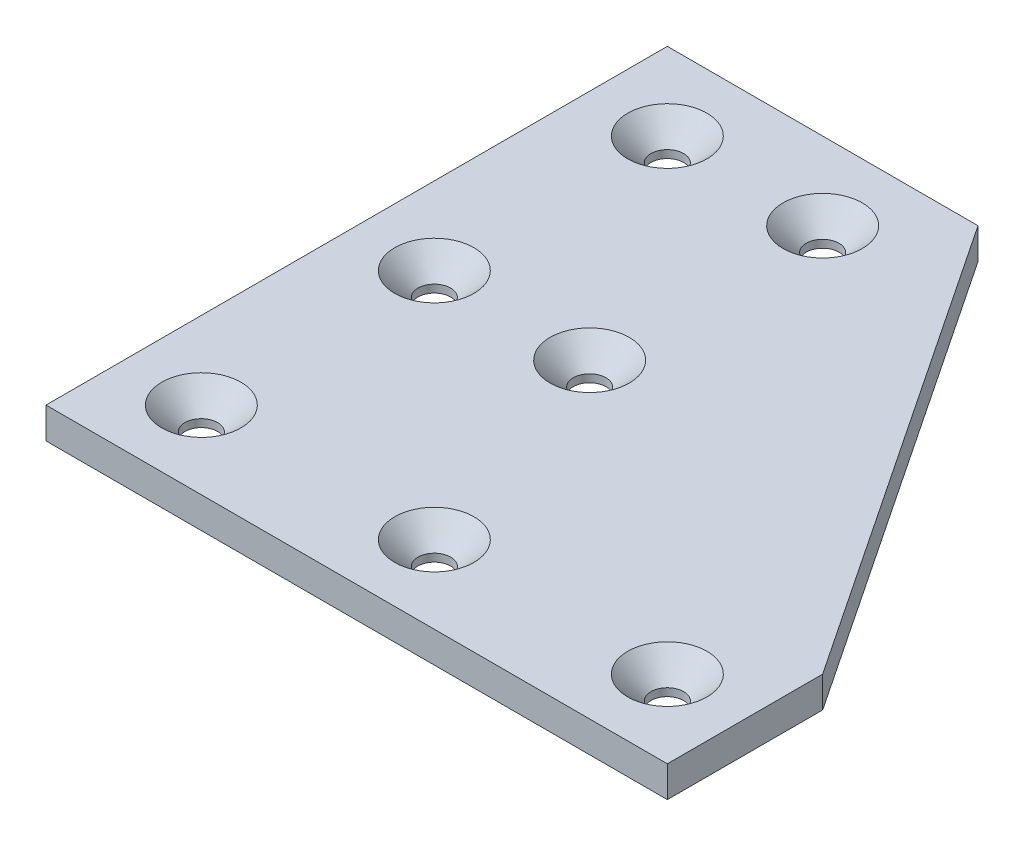
ISO-10303-21;
HEADER;
FILE_DESCRIPTION(('STEP AP214'),'2;1');
FILE_NAME('part.step','',(''),(''),'','','');
FILE_SCHEMA(('AUTOMOTIVE_DESIGN { 1 0 10303 214 1 1 1 1 }'));
ENDSEC;
DATA;
#1=APPLICATION_CONTEXT('core data for automotive mechanical design processes');
#2=APPLICATION_PROTOCOL_DEFINITION('international standard','automotive_design',2000,#1);
#3=PRODUCT_CONTEXT('',#1,'mechanical');
#4=PRODUCT('Part','Part','',(#3));
#5=PRODUCT_RELATED_PRODUCT_CATEGORY('part','',(#4));
#6=PRODUCT_DEFINITION_FORMATION('','',#4);
#7=PRODUCT_DEFINITION_CONTEXT('part definition',#1,'design');
#8=PRODUCT_DEFINITION('design','',#6,#7);
#9=PRODUCT_DEFINITION_SHAPE('','',#8);
#10=(LENGTH_UNIT() NAMED_UNIT(*) SI_UNIT(.MILLI.,.METRE.));
#11=(NAMED_UNIT(*) PLANE_ANGLE_UNIT() SI_UNIT($,.RADIAN.));
#12=(NAMED_UNIT(*) SI_UNIT($,.STERADIAN.) SOLID_ANGLE_UNIT());
#13=UNCERTAINTY_MEASURE_WITH_UNIT(LENGTH_MEASURE(1.E-05),#10,'distance_accuracy_value','');
#14=(GEOMETRIC_REPRESENTATION_CONTEXT(3) GLOBAL_UNCERTAINTY_ASSIGNED_CONTEXT((#13)) GLOBAL_UNIT_ASSIGNED_CONTEXT((#10,
#11,#12)) REPRESENTATION_CONTEXT('',''));
#15=CARTESIAN_POINT('',(0.,0.,0.));
#16=DIRECTION('',(0.,0.,1.));
#17=DIRECTION('',(1.,0.,0.));
#18=AXIS2_PLACEMENT_3D('',#15,#16,#17);
#19=CARTESIAN_POINT('',(0.,4.,-80.));
#20=DIRECTION('',(1.,0.,0.));
#21=DIRECTION('',(0.,0.,-1.));
#22=AXIS2_PLACEMENT_3D('',#19,#20,#21);
#23=PLANE('',#22);
#24=DIRECTION('',(0.,0.,1.));
#25=VECTOR('',#24,1.);
#26=CARTESIAN_POINT('',(0.,0.,-80.));
#27=LINE('',#26,#25);
#28=CARTESIAN_POINT('',(0.,0.,-80.));
#29=VERTEX_POINT('',#28);
#30=CARTESIAN_POINT('',(0.,0.,0.));
#31=VERTEX_POINT('',#30);
#32=EDGE_CURVE('E128',#29,#31,#27,.T.);
#33=ORIENTED_EDGE('',*,*,#32,.T.);
#34=DIRECTION('',(0.,-1.,0.));
#35=VECTOR('',#34,1.);
#36=CARTESIAN_POINT('',(0.,4.,0.));
#37=LINE('',#36,#35);
#38=CARTESIAN_POINT('',(0.,4.,0.));
#39=VERTEX_POINT('',#38);
#40=EDGE_CURVE('E149',#39,#31,#37,.T.);
#41=ORIENTED_EDGE('',*,*,#40,.F.);
#42=DIRECTION('',(0.,0.,1.));
#43=VECTOR('',#42,1.);
#44=CARTESIAN_POINT('',(0.,4.,-80.));
#45=LINE('',#44,#43);
#46=CARTESIAN_POINT('',(0.,4.,-80.));
#47=VERTEX_POINT('',#46);
#48=EDGE_CURVE('E142',#47,#39,#45,.T.);
#49=ORIENTED_EDGE('',*,*,#48,.F.);
#50=DIRECTION('',(0.,-1.,0.));
#51=VECTOR('',#50,1.);
#52=CARTESIAN_POINT('',(0.,4.,-80.));
#53=LINE('',#52,#51);
#54=EDGE_CURVE('E124',#47,#29,#53,.T.);
#55=ORIENTED_EDGE('',*,*,#54,.T.);
#56=EDGE_LOOP('',(#33,#41,#49,#55));
#57=FACE_BOUND('',#56,.T.);
#58=ADVANCED_FACE('F45',(#57),#23,.F.);
#59=CARTESIAN_POINT('',(0.,4.,0.));
#60=DIRECTION('',(0.,0.,-1.));
#61=DIRECTION('',(-1.,0.,0.));
#62=AXIS2_PLACEMENT_3D('',#59,#60,#61);
#63=PLANE('',#62);
#64=DIRECTION('',(1.,0.,0.));
#65=VECTOR('',#64,1.);
#66=CARTESIAN_POINT('',(0.,0.,0.));
#67=LINE('',#66,#65);
#68=CARTESIAN_POINT('',(80.,0.,0.));
#69=VERTEX_POINT('',#68);
#70=EDGE_CURVE('E132',#31,#69,#67,.T.);
#71=ORIENTED_EDGE('',*,*,#70,.T.);
#72=DIRECTION('',(0.,-1.,0.));
#73=VECTOR('',#72,1.);
#74=CARTESIAN_POINT('',(80.,4.,0.));
#75=LINE('',#74,#73);
#76=CARTESIAN_POINT('',(80.,4.,0.));
#77=VERTEX_POINT('',#76);
#78=EDGE_CURVE('E117',#77,#69,#75,.T.);
#79=ORIENTED_EDGE('',*,*,#78,.F.);
#80=DIRECTION('',(1.,0.,0.));
#81=VECTOR('',#80,1.);
#82=CARTESIAN_POINT('',(0.,4.,0.));
#83=LINE('',#82,#81);
#84=EDGE_CURVE('E99',#39,#77,#83,.T.);
#85=ORIENTED_EDGE('',*,*,#84,.F.);
#86=ORIENTED_EDGE('',*,*,#40,.T.);
#87=EDGE_LOOP('',(#71,#79,#85,#86));
#88=FACE_BOUND('',#87,.T.);
#89=ADVANCED_FACE('F221',(#88),#63,.F.);
#90=CARTESIAN_POINT('',(80.,4.,0.));
#91=DIRECTION('',(-1.,0.,0.));
#92=DIRECTION('',(0.,0.,1.));
#93=AXIS2_PLACEMENT_3D('',#90,#91,#92);
#94=PLANE('',#93);
#95=DIRECTION('',(0.,0.,-1.));
#96=VECTOR('',#95,1.);
#97=CARTESIAN_POINT('',(80.,0.,0.));
#98=LINE('',#97,#96);
#99=CARTESIAN_POINT('',(80.,0.,-20.));
#100=VERTEX_POINT('',#99);
#101=EDGE_CURVE('E115',#69,#100,#98,.T.);
#102=ORIENTED_EDGE('',*,*,#101,.T.);
#103=DIRECTION('',(0.,-1.,0.));
#104=VECTOR('',#103,1.);
#105=CARTESIAN_POINT('',(80.,4.,-20.));
#106=LINE('',#105,#104);
#107=CARTESIAN_POINT('',(80.,4.,-20.));
#108=VERTEX_POINT('',#107);
#109=EDGE_CURVE('E112',#108,#100,#106,.T.);
#110=ORIENTED_EDGE('',*,*,#109,.F.);
#111=DIRECTION('',(0.,0.,-1.));
#112=VECTOR('',#111,1.);
#113=CARTESIAN_POINT('',(80.,4.,0.));
#114=LINE('',#113,#112);
#115=EDGE_CURVE('E103',#77,#108,#114,.T.);
#116=ORIENTED_EDGE('',*,*,#115,.F.);
#117=ORIENTED_EDGE('',*,*,#78,.T.);
#118=EDGE_LOOP('',(#102,#110,#116,#117));
#119=FACE_BOUND('',#118,.T.);
#120=ADVANCED_FACE('F113',(#119),#94,.F.);
#121=CARTESIAN_POINT('',(80.,4.,-20.));
#122=DIRECTION('',(-0.832050294337844,0.,0.554700196225229));
#123=DIRECTION('',(0.554700196225229,0.,0.832050294337844));
#124=AXIS2_PLACEMENT_3D('',#121,#122,#123);
#125=PLANE('',#124);
#126=DIRECTION('',(-0.554700196225229,0.,-0.832050294337844));
#127=VECTOR('',#126,1.);
#128=CARTESIAN_POINT('',(80.,0.,-20.));
#129=LINE('',#128,#127);
#130=CARTESIAN_POINT('',(40.,0.,-80.));
#131=VERTEX_POINT('',#130);
#132=EDGE_CURVE('E84',#100,#131,#129,.T.);
#133=ORIENTED_EDGE('',*,*,#132,.T.);
#134=DIRECTION('',(0.,-1.,0.));
#135=VECTOR('',#134,1.);
#136=CARTESIAN_POINT('',(40.,4.,-80.));
#137=LINE('',#136,#135);
#138=CARTESIAN_POINT('',(40.,4.,-80.));
#139=VERTEX_POINT('',#138);
#140=EDGE_CURVE('E118',#139,#131,#137,.T.);
#141=ORIENTED_EDGE('',*,*,#140,.F.);
#142=DIRECTION('',(-0.554700196225229,0.,-0.832050294337844));
#143=VECTOR('',#142,1.);
#144=CARTESIAN_POINT('',(80.,4.,-20.));
#145=LINE('',#144,#143);
#146=EDGE_CURVE('E107',#108,#139,#145,.T.);
#147=ORIENTED_EDGE('',*,*,#146,.F.);
#148=ORIENTED_EDGE('',*,*,#109,.T.);
#149=EDGE_LOOP('',(#133,#141,#147,#148));
#150=FACE_BOUND('',#149,.T.);
#151=ADVANCED_FACE('F120',(#150),#125,.F.);
#152=CARTESIAN_POINT('',(40.,4.,-80.));
#153=DIRECTION('',(0.,0.,1.));
#154=DIRECTION('',(1.,0.,0.));
#155=AXIS2_PLACEMENT_3D('',#152,#153,#154);
#156=PLANE('',#155);
#157=DIRECTION('',(-1.,0.,0.));
#158=VECTOR('',#157,1.);
#159=CARTESIAN_POINT('',(40.,0.,-80.));
#160=LINE('',#159,#158);
#161=EDGE_CURVE('E90',#131,#29,#160,.T.);
#162=ORIENTED_EDGE('',*,*,#161,.T.);
#163=ORIENTED_EDGE('',*,*,#54,.F.);
#164=DIRECTION('',(-1.,0.,0.));
#165=VECTOR('',#164,1.);
#166=CARTESIAN_POINT('',(40.,4.,-80.));
#167=LINE('',#166,#165);
#168=EDGE_CURVE('E64',#139,#47,#167,.T.);
#169=ORIENTED_EDGE('',*,*,#168,.F.);
#170=ORIENTED_EDGE('',*,*,#140,.T.);
#171=EDGE_LOOP('',(#162,#163,#169,#170));
#172=FACE_BOUND('',#171,.T.);
#173=ADVANCED_FACE('F337',(#172),#156,.F.);
#174=CARTESIAN_POINT('',(0.,4.,0.));
#175=DIRECTION('',(0.,1.,0.));
#176=DIRECTION('',(0.,0.,1.));
#177=AXIS2_PLACEMENT_3D('',#174,#175,#176);
#178=PLANE('',#177);
#179=CARTESIAN_POINT('',(70.,4.,-9.99999999999999));
#180=DIRECTION('',(0.,1.,0.));
#181=DIRECTION('',(0.,0.,1.));
#182=AXIS2_PLACEMENT_3D('',#179,#180,#181);
#183=CIRCLE('',#182,5.10000000000001);
#184=CARTESIAN_POINT('',(70.,4.,-4.89999999999999));
#185=VERTEX_POINT('',#184);
#186=EDGE_CURVE('E180',#185,#185,#183,.F.);
#187=ORIENTED_EDGE('',*,*,#186,.T.);
#188=EDGE_LOOP('',(#187));
#189=FACE_BOUND('',#188,.T.);
#190=CARTESIAN_POINT('',(40.,4.,-9.99999999999999));
#191=DIRECTION('',(0.,1.,0.));
#192=DIRECTION('',(0.,0.,1.));
#193=AXIS2_PLACEMENT_3D('',#190,#191,#192);
#194=CIRCLE('',#193,5.10000000000001);
#195=CARTESIAN_POINT('',(40.,4.,-4.89999999999999));
#196=VERTEX_POINT('',#195);
#197=EDGE_CURVE('E176',#196,#196,#194,.F.);
#198=ORIENTED_EDGE('',*,*,#197,.T.);
#199=EDGE_LOOP('',(#198));
#200=FACE_BOUND('',#199,.T.);
#201=CARTESIAN_POINT('',(10.,4.,-9.99999999999999));
#202=DIRECTION('',(0.,1.,0.));
#203=DIRECTION('',(0.,0.,1.));
#204=AXIS2_PLACEMENT_3D('',#201,#202,#203);
#205=CIRCLE('',#204,5.10000000000001);
#206=CARTESIAN_POINT('',(10.,4.,-4.89999999999999));
#207=VERTEX_POINT('',#206);
#208=EDGE_CURVE('E172',#207,#207,#205,.F.);
#209=ORIENTED_EDGE('',*,*,#208,.T.);
#210=EDGE_LOOP('',(#209));
#211=FACE_BOUND('',#210,.T.);
#212=CARTESIAN_POINT('',(29.9999999999999,4.,-40.));
#213=DIRECTION('',(0.,1.,0.));
#214=DIRECTION('',(0.,0.,1.));
#215=AXIS2_PLACEMENT_3D('',#212,#213,#214);
#216=CIRCLE('',#215,5.10000000000004);
#217=CARTESIAN_POINT('',(29.9999999999999,4.,-34.9));
#218=VERTEX_POINT('',#217);
#219=EDGE_CURVE('E168',#218,#218,#216,.F.);
#220=ORIENTED_EDGE('',*,*,#219,.T.);
#221=EDGE_LOOP('',(#220));
#222=FACE_BOUND('',#221,.T.);
#223=CARTESIAN_POINT('',(9.9999999999999,4.,-40.));
#224=DIRECTION('',(0.,1.,0.));
#225=DIRECTION('',(0.,0.,1.));
#226=AXIS2_PLACEMENT_3D('',#223,#224,#225);
#227=CIRCLE('',#226,5.10000000000004);
#228=CARTESIAN_POINT('',(9.9999999999999,4.,-34.9));
#229=VERTEX_POINT('',#228);
#230=EDGE_CURVE('E164',#229,#229,#227,.F.);
#231=ORIENTED_EDGE('',*,*,#230,.T.);
#232=EDGE_LOOP('',(#231));
#233=FACE_BOUND('',#232,.T.);
#234=CARTESIAN_POINT('',(29.9999999999998,4.,-70.));
#235=DIRECTION('',(0.,1.,0.));
#236=DIRECTION('',(0.,0.,1.));
#237=AXIS2_PLACEMENT_3D('',#234,#235,#236);
#238=CIRCLE('',#237,5.10000000000001);
#239=CARTESIAN_POINT('',(29.9999999999998,4.,-64.9));
#240=VERTEX_POINT('',#239);
#241=EDGE_CURVE('E160',#240,#240,#238,.F.);
#242=ORIENTED_EDGE('',*,*,#241,.T.);
#243=EDGE_LOOP('',(#242));
#244=FACE_BOUND('',#243,.T.);
#245=CARTESIAN_POINT('',(9.99999999999979,4.,-70.));
#246=DIRECTION('',(0.,1.,0.));
#247=DIRECTION('',(0.,0.,1.));
#248=AXIS2_PLACEMENT_3D('',#245,#246,#247);
#249=CIRCLE('',#248,5.10000000000001);
#250=CARTESIAN_POINT('',(9.99999999999979,4.,-64.9));
#251=VERTEX_POINT('',#250);
#252=EDGE_CURVE('E156',#251,#251,#249,.F.);
#253=ORIENTED_EDGE('',*,*,#252,.T.);
#254=EDGE_LOOP('',(#253));
#255=FACE_BOUND('',#254,.T.);
#256=ORIENTED_EDGE('',*,*,#48,.T.);
#257=ORIENTED_EDGE('',*,*,#84,.T.);
#258=ORIENTED_EDGE('',*,*,#115,.T.);
#259=ORIENTED_EDGE('',*,*,#146,.T.);
#260=ORIENTED_EDGE('',*,*,#168,.T.);
#261=EDGE_LOOP('',(#256,#257,#258,#259,#260));
#262=FACE_BOUND('',#261,.T.);
#263=ADVANCED_FACE('F105',(#189,#200,#211,#222,#233,#244,#255,#262),#178,.T.);
#264=CARTESIAN_POINT('',(0.,0.,0.));
#265=DIRECTION('',(0.,1.,0.));
#266=DIRECTION('',(0.,0.,1.));
#267=AXIS2_PLACEMENT_3D('',#264,#265,#266);
#268=PLANE('',#267);
#269=CARTESIAN_POINT('',(9.99999999999979,0.,-70.));
#270=DIRECTION('',(0.,1.,0.));
#271=DIRECTION('',(0.,0.,1.));
#272=AXIS2_PLACEMENT_3D('',#269,#270,#271);
#273=CIRCLE('',#272,2.1);
#274=CARTESIAN_POINT('',(9.99999999999979,0.,-67.9));
#275=VERTEX_POINT('',#274);
#276=EDGE_CURVE('E296',#275,#275,#273,.T.);
#277=ORIENTED_EDGE('',*,*,#276,.T.);
#278=EDGE_LOOP('',(#277));
#279=FACE_BOUND('',#278,.T.);
#280=CARTESIAN_POINT('',(9.9999999999999,0.,-40.));
#281=DIRECTION('',(0.,1.,0.));
#282=DIRECTION('',(0.,0.,1.));
#283=AXIS2_PLACEMENT_3D('',#280,#281,#282);
#284=CIRCLE('',#283,2.1);
#285=CARTESIAN_POINT('',(9.9999999999999,0.,-37.9));
#286=VERTEX_POINT('',#285);
#287=EDGE_CURVE('E289',#286,#286,#284,.T.);
#288=ORIENTED_EDGE('',*,*,#287,.T.);
#289=EDGE_LOOP('',(#288));
#290=FACE_BOUND('',#289,.T.);
#291=CARTESIAN_POINT('',(29.9999999999998,0.,-70.));
#292=DIRECTION('',(0.,1.,0.));
#293=DIRECTION('',(0.,0.,1.));
#294=AXIS2_PLACEMENT_3D('',#291,#292,#293);
#295=CIRCLE('',#294,2.1);
#296=CARTESIAN_POINT('',(29.9999999999998,0.,-67.9));
#297=VERTEX_POINT('',#296);
#298=EDGE_CURVE('E281',#297,#297,#295,.T.);
#299=ORIENTED_EDGE('',*,*,#298,.T.);
#300=EDGE_LOOP('',(#299));
#301=FACE_BOUND('',#300,.T.);
#302=CARTESIAN_POINT('',(29.9999999999999,0.,-40.));
#303=DIRECTION('',(0.,1.,0.));
#304=DIRECTION('',(0.,0.,1.));
#305=AXIS2_PLACEMENT_3D('',#302,#303,#304);
#306=CIRCLE('',#305,2.1);
#307=CARTESIAN_POINT('',(29.9999999999999,0.,-37.9));
#308=VERTEX_POINT('',#307);
#309=EDGE_CURVE('E277',#308,#308,#306,.T.);
#310=ORIENTED_EDGE('',*,*,#309,.T.);
#311=EDGE_LOOP('',(#310));
#312=FACE_BOUND('',#311,.T.);
#313=CARTESIAN_POINT('',(70.,0.,-9.99999999999999));
#314=DIRECTION('',(0.,1.,0.));
#315=DIRECTION('',(0.,0.,1.));
#316=AXIS2_PLACEMENT_3D('',#313,#314,#315);
#317=CIRCLE('',#316,2.1);
#318=CARTESIAN_POINT('',(70.,0.,-7.89999999999999));
#319=VERTEX_POINT('',#318);
#320=EDGE_CURVE('E280',#319,#319,#317,.T.);
#321=ORIENTED_EDGE('',*,*,#320,.T.);
#322=EDGE_LOOP('',(#321));
#323=FACE_BOUND('',#322,.T.);
#324=CARTESIAN_POINT('',(40.,0.,-9.99999999999999));
#325=DIRECTION('',(0.,1.,0.));
#326=DIRECTION('',(0.,0.,1.));
#327=AXIS2_PLACEMENT_3D('',#324,#325,#326);
#328=CIRCLE('',#327,2.1);
#329=CARTESIAN_POINT('',(40.,0.,-7.9));
#330=VERTEX_POINT('',#329);
#331=EDGE_CURVE('E286',#330,#330,#328,.T.);
#332=ORIENTED_EDGE('',*,*,#331,.T.);
#333=EDGE_LOOP('',(#332));
#334=FACE_BOUND('',#333,.T.);
#335=CARTESIAN_POINT('',(10.,0.,-9.99999999999999));
#336=DIRECTION('',(0.,1.,0.));
#337=DIRECTION('',(0.,0.,1.));
#338=AXIS2_PLACEMENT_3D('',#335,#336,#337);
#339=CIRCLE('',#338,2.1);
#340=CARTESIAN_POINT('',(10.,0.,-7.89999999999999));
#341=VERTEX_POINT('',#340);
#342=EDGE_CURVE('E133',#341,#341,#339,.T.);
#343=ORIENTED_EDGE('',*,*,#342,.T.);
#344=EDGE_LOOP('',(#343));
#345=FACE_BOUND('',#344,.T.);
#346=ORIENTED_EDGE('',*,*,#32,.F.);
#347=ORIENTED_EDGE('',*,*,#161,.F.);
#348=ORIENTED_EDGE('',*,*,#132,.F.);
#349=ORIENTED_EDGE('',*,*,#101,.F.);
#350=ORIENTED_EDGE('',*,*,#70,.F.);
#351=EDGE_LOOP('',(#346,#347,#348,#349,#350));
#352=FACE_BOUND('',#351,.T.);
#353=ADVANCED_FACE('F309',(#279,#290,#301,#312,#323,#334,#345,#352),#268,.F.);
#354=CARTESIAN_POINT('',(10.,0.,-9.99999999999999));
#355=DIRECTION('',(0.,1.,0.));
#356=DIRECTION('',(0.,0.,1.));
#357=AXIS2_PLACEMENT_3D('',#354,#355,#356);
#358=CYLINDRICAL_SURFACE('',#357,2.1);
#359=CARTESIAN_POINT('',(10.,1.,-9.99999999999999));
#360=DIRECTION('',(0.,1.,0.));
#361=DIRECTION('',(0.,0.,1.));
#362=AXIS2_PLACEMENT_3D('',#359,#360,#361);
#363=CIRCLE('',#362,2.1);
#364=CARTESIAN_POINT('',(10.,1.,-7.89999999999999));
#365=VERTEX_POINT('',#364);
#366=EDGE_CURVE('E188',#365,#365,#363,.T.);
#367=ORIENTED_EDGE('',*,*,#366,.T.);
#368=EDGE_LOOP('',(#367));
#369=FACE_BOUND('',#368,.T.);
#370=ORIENTED_EDGE('',*,*,#342,.F.);
#371=EDGE_LOOP('',(#370));
#372=FACE_BOUND('',#371,.T.);
#373=ADVANCED_FACE('F314',(#369,#372),#358,.F.);
#374=CARTESIAN_POINT('',(40.,0.,-9.99999999999999));
#375=DIRECTION('',(0.,1.,0.));
#376=DIRECTION('',(0.,0.,1.));
#377=AXIS2_PLACEMENT_3D('',#374,#375,#376);
#378=CYLINDRICAL_SURFACE('',#377,2.1);
#379=CARTESIAN_POINT('',(40.,0.999999999999997,-9.99999999999999));
#380=DIRECTION('',(0.,1.,0.));
#381=DIRECTION('',(0.,0.,1.));
#382=AXIS2_PLACEMENT_3D('',#379,#380,#381);
#383=CIRCLE('',#382,2.1);
#384=CARTESIAN_POINT('',(40.,0.999999999999997,-7.9));
#385=VERTEX_POINT('',#384);
#386=EDGE_CURVE('E184',#385,#385,#383,.T.);
#387=ORIENTED_EDGE('',*,*,#386,.T.);
#388=EDGE_LOOP('',(#387));
#389=FACE_BOUND('',#388,.T.);
#390=ORIENTED_EDGE('',*,*,#331,.F.);
#391=EDGE_LOOP('',(#390));
#392=FACE_BOUND('',#391,.T.);
#393=ADVANCED_FACE('F312',(#389,#392),#378,.F.);
#394=CARTESIAN_POINT('',(70.,0.,-9.99999999999999));
#395=DIRECTION('',(0.,1.,0.));
#396=DIRECTION('',(0.,0.,1.));
#397=AXIS2_PLACEMENT_3D('',#394,#395,#396);
#398=CYLINDRICAL_SURFACE('',#397,2.1);
#399=CARTESIAN_POINT('',(70.,1.,-9.99999999999999));
#400=DIRECTION('',(0.,1.,0.));
#401=DIRECTION('',(0.,0.,1.));
#402=AXIS2_PLACEMENT_3D('',#399,#400,#401);
#403=CIRCLE('',#402,2.1);
#404=CARTESIAN_POINT('',(70.,1.,-7.89999999999999));
#405=VERTEX_POINT('',#404);
#406=EDGE_CURVE('E152',#405,#405,#403,.T.);
#407=ORIENTED_EDGE('',*,*,#406,.T.);
#408=EDGE_LOOP('',(#407));
#409=FACE_BOUND('',#408,.T.);
#410=ORIENTED_EDGE('',*,*,#320,.F.);
#411=EDGE_LOOP('',(#410));
#412=FACE_BOUND('',#411,.T.);
#413=ADVANCED_FACE('F273',(#409,#412),#398,.F.);
#414=CARTESIAN_POINT('',(29.9999999999999,0.,-40.));
#415=DIRECTION('',(0.,1.,0.));
#416=DIRECTION('',(0.,0.,1.));
#417=AXIS2_PLACEMENT_3D('',#414,#415,#416);
#418=CYLINDRICAL_SURFACE('',#417,2.1);
#419=CARTESIAN_POINT('',(29.9999999999999,0.999999999999977,-40.));
#420=DIRECTION('',(0.,1.,0.));
#421=DIRECTION('',(0.,0.,1.));
#422=AXIS2_PLACEMENT_3D('',#419,#420,#421);
#423=CIRCLE('',#422,2.1);
#424=CARTESIAN_POINT('',(29.9999999999999,0.999999999999977,-37.9));
#425=VERTEX_POINT('',#424);
#426=EDGE_CURVE('E192',#425,#425,#423,.T.);
#427=ORIENTED_EDGE('',*,*,#426,.T.);
#428=EDGE_LOOP('',(#427));
#429=FACE_BOUND('',#428,.T.);
#430=ORIENTED_EDGE('',*,*,#309,.F.);
#431=EDGE_LOOP('',(#430));
#432=FACE_BOUND('',#431,.T.);
#433=ADVANCED_FACE('F270',(#429,#432),#418,.F.);
#434=CARTESIAN_POINT('',(29.9999999999998,0.,-70.));
#435=DIRECTION('',(0.,1.,0.));
#436=DIRECTION('',(0.,0.,1.));
#437=AXIS2_PLACEMENT_3D('',#434,#435,#436);
#438=CYLINDRICAL_SURFACE('',#437,2.1);
#439=CARTESIAN_POINT('',(29.9999999999998,0.999999999999998,-70.));
#440=DIRECTION('',(0.,1.,0.));
#441=DIRECTION('',(0.,0.,1.));
#442=AXIS2_PLACEMENT_3D('',#439,#440,#441);
#443=CIRCLE('',#442,2.1);
#444=CARTESIAN_POINT('',(29.9999999999998,0.999999999999998,-67.9));
#445=VERTEX_POINT('',#444);
#446=EDGE_CURVE('E56',#445,#445,#443,.T.);
#447=ORIENTED_EDGE('',*,*,#446,.T.);
#448=EDGE_LOOP('',(#447));
#449=FACE_BOUND('',#448,.T.);
#450=ORIENTED_EDGE('',*,*,#298,.F.);
#451=EDGE_LOOP('',(#450));
#452=FACE_BOUND('',#451,.T.);
#453=ADVANCED_FACE('F203',(#449,#452),#438,.F.);
#454=CARTESIAN_POINT('',(9.9999999999999,0.,-40.));
#455=DIRECTION('',(0.,1.,0.));
#456=DIRECTION('',(0.,0.,1.));
#457=AXIS2_PLACEMENT_3D('',#454,#455,#456);
#458=CYLINDRICAL_SURFACE('',#457,2.1);
#459=CARTESIAN_POINT('',(9.9999999999999,0.999999999999974,-40.));
#460=DIRECTION('',(0.,1.,0.));
#461=DIRECTION('',(0.,0.,1.));
#462=AXIS2_PLACEMENT_3D('',#459,#460,#461);
#463=CIRCLE('',#462,2.1);
#464=CARTESIAN_POINT('',(9.9999999999999,0.999999999999974,-37.9));
#465=VERTEX_POINT('',#464);
#466=EDGE_CURVE('E196',#465,#465,#463,.T.);
#467=ORIENTED_EDGE('',*,*,#466,.T.);
#468=EDGE_LOOP('',(#467));
#469=FACE_BOUND('',#468,.T.);
#470=ORIENTED_EDGE('',*,*,#287,.F.);
#471=EDGE_LOOP('',(#470));
#472=FACE_BOUND('',#471,.T.);
#473=ADVANCED_FACE('F328',(#469,#472),#458,.F.);
#474=CARTESIAN_POINT('',(9.99999999999979,0.,-70.));
#475=DIRECTION('',(0.,1.,0.));
#476=DIRECTION('',(0.,0.,1.));
#477=AXIS2_PLACEMENT_3D('',#474,#475,#476);
#478=CYLINDRICAL_SURFACE('',#477,2.1);
#479=CARTESIAN_POINT('',(9.99999999999979,1.,-70.));
#480=DIRECTION('',(0.,1.,0.));
#481=DIRECTION('',(0.,0.,1.));
#482=AXIS2_PLACEMENT_3D('',#479,#480,#481);
#483=CIRCLE('',#482,2.1);
#484=CARTESIAN_POINT('',(9.99999999999979,1.,-67.9));
#485=VERTEX_POINT('',#484);
#486=EDGE_CURVE('E11',#485,#485,#483,.T.);
#487=ORIENTED_EDGE('',*,*,#486,.T.);
#488=EDGE_LOOP('',(#487));
#489=FACE_BOUND('',#488,.T.);
#490=ORIENTED_EDGE('',*,*,#276,.F.);
#491=EDGE_LOOP('',(#490));
#492=FACE_BOUND('',#491,.T.);
#493=ADVANCED_FACE('F238',(#489,#492),#478,.F.);
#494=CARTESIAN_POINT('',(70.,1.,-9.99999999999999));
#495=DIRECTION('',(0.,1.,0.));
#496=DIRECTION('',(0.,0.,1.));
#497=AXIS2_PLACEMENT_3D('',#494,#495,#496);
#498=CONICAL_SURFACE('',#497,2.1,0.785398163397449);
#499=ORIENTED_EDGE('',*,*,#186,.F.);
#500=EDGE_LOOP('',(#499));
#501=FACE_BOUND('',#500,.T.);
#502=ORIENTED_EDGE('',*,*,#406,.F.);
#503=EDGE_LOOP('',(#502));
#504=FACE_BOUND('',#503,.T.);
#505=ADVANCED_FACE('F231',(#501,#504),#498,.F.);
#506=CARTESIAN_POINT('',(40.,0.999999999999997,-9.99999999999999));
#507=DIRECTION('',(0.,1.,0.));
#508=DIRECTION('',(0.,0.,1.));
#509=AXIS2_PLACEMENT_3D('',#506,#507,#508);
#510=CONICAL_SURFACE('',#509,2.1,0.785398163397449);
#511=ORIENTED_EDGE('',*,*,#197,.F.);
#512=EDGE_LOOP('',(#511));
#513=FACE_BOUND('',#512,.T.);
#514=ORIENTED_EDGE('',*,*,#386,.F.);
#515=EDGE_LOOP('',(#514));
#516=FACE_BOUND('',#515,.T.);
#517=ADVANCED_FACE('F237',(#513,#516),#510,.F.);
#518=CARTESIAN_POINT('',(10.,1.,-9.99999999999999));
#519=DIRECTION('',(0.,1.,0.));
#520=DIRECTION('',(0.,0.,1.));
#521=AXIS2_PLACEMENT_3D('',#518,#519,#520);
#522=CONICAL_SURFACE('',#521,2.1,0.785398163397449);
#523=ORIENTED_EDGE('',*,*,#208,.F.);
#524=EDGE_LOOP('',(#523));
#525=FACE_BOUND('',#524,.T.);
#526=ORIENTED_EDGE('',*,*,#366,.F.);
#527=EDGE_LOOP('',(#526));
#528=FACE_BOUND('',#527,.T.);
#529=ADVANCED_FACE('F245',(#525,#528),#522,.F.);
#530=CARTESIAN_POINT('',(29.9999999999999,0.999999999999977,-40.));
#531=DIRECTION('',(0.,1.,0.));
#532=DIRECTION('',(0.,0.,1.));
#533=AXIS2_PLACEMENT_3D('',#530,#531,#532);
#534=CONICAL_SURFACE('',#533,2.1,0.785398163397449);
#535=ORIENTED_EDGE('',*,*,#219,.F.);
#536=EDGE_LOOP('',(#535));
#537=FACE_BOUND('',#536,.T.);
#538=ORIENTED_EDGE('',*,*,#426,.F.);
#539=EDGE_LOOP('',(#538));
#540=FACE_BOUND('',#539,.T.);
#541=ADVANCED_FACE('F215',(#537,#540),#534,.F.);
#542=CARTESIAN_POINT('',(9.9999999999999,0.999999999999974,-40.));
#543=DIRECTION('',(0.,1.,0.));
#544=DIRECTION('',(0.,0.,1.));
#545=AXIS2_PLACEMENT_3D('',#542,#543,#544);
#546=CONICAL_SURFACE('',#545,2.1,0.785398163397449);
#547=ORIENTED_EDGE('',*,*,#230,.F.);
#548=EDGE_LOOP('',(#547));
#549=FACE_BOUND('',#548,.T.);
#550=ORIENTED_EDGE('',*,*,#466,.F.);
#551=EDGE_LOOP('',(#550));
#552=FACE_BOUND('',#551,.T.);
#553=ADVANCED_FACE('F208',(#549,#552),#546,.F.);
#554=CARTESIAN_POINT('',(29.9999999999998,0.999999999999998,-70.));
#555=DIRECTION('',(0.,1.,0.));
#556=DIRECTION('',(0.,0.,1.));
#557=AXIS2_PLACEMENT_3D('',#554,#555,#556);
#558=CONICAL_SURFACE('',#557,2.1,0.785398163397449);
#559=ORIENTED_EDGE('',*,*,#241,.F.);
#560=EDGE_LOOP('',(#559));
#561=FACE_BOUND('',#560,.T.);
#562=ORIENTED_EDGE('',*,*,#446,.F.);
#563=EDGE_LOOP('',(#562));
#564=FACE_BOUND('',#563,.T.);
#565=ADVANCED_FACE('F206',(#561,#564),#558,.F.);
#566=CARTESIAN_POINT('',(9.99999999999979,1.,-70.));
#567=DIRECTION('',(0.,1.,0.));
#568=DIRECTION('',(0.,0.,1.));
#569=AXIS2_PLACEMENT_3D('',#566,#567,#568);
#570=CONICAL_SURFACE('',#569,2.1,0.785398163397449);
#571=ORIENTED_EDGE('',*,*,#252,.F.);
#572=EDGE_LOOP('',(#571));
#573=FACE_BOUND('',#572,.T.);
#574=ORIENTED_EDGE('',*,*,#486,.F.);
#575=EDGE_LOOP('',(#574));
#576=FACE_BOUND('',#575,.T.);
#577=ADVANCED_FACE('F48',(#573,#576),#570,.F.);
#578=CLOSED_SHELL('',(#58,#89,#120,#151,#173,#263,#353,#373,#393,#413,#433,#453,#473,#493,#505,
#517,#529,#541,#553,#565,#577));
#579=MANIFOLD_SOLID_BREP('B2',#578);
#580=ADVANCED_BREP_SHAPE_REPRESENTATION('',(#18,#579),#14);
#581=SHAPE_DEFINITION_REPRESENTATION(#9,#580);
ENDSEC;
END-ISO-10303-21;
